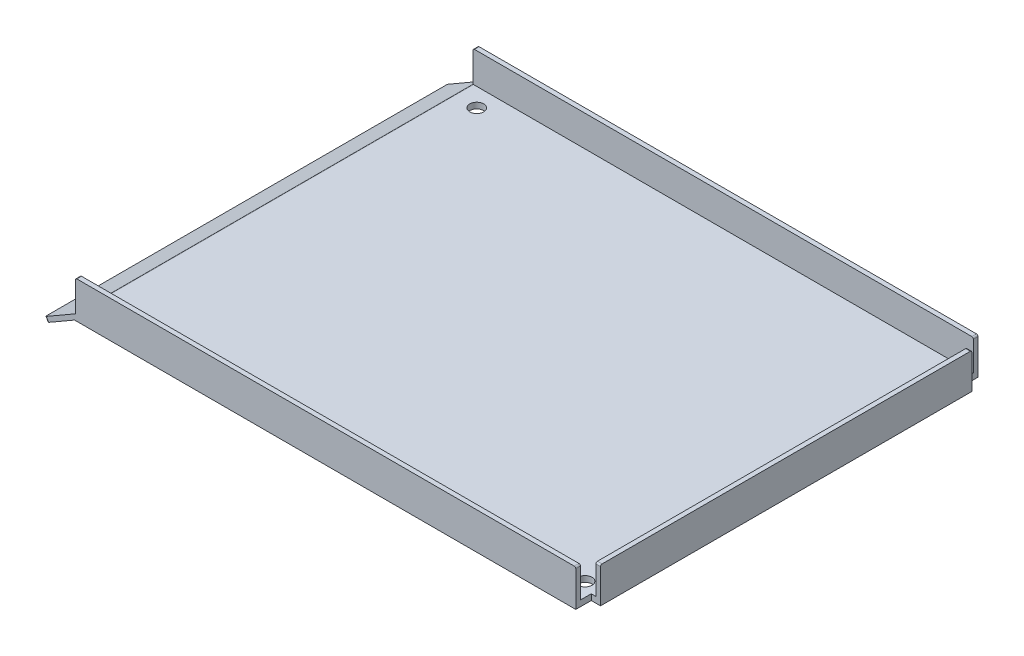
ISO-10303-21;
HEADER;
FILE_DESCRIPTION(('STEP AP214'),'2;1');
FILE_NAME('part.step','',(''),(''),'','','');
FILE_SCHEMA(('AUTOMOTIVE_DESIGN { 1 0 10303 214 1 1 1 1 }'));
ENDSEC;
DATA;
#1=APPLICATION_CONTEXT('core data for automotive mechanical design processes');
#2=APPLICATION_PROTOCOL_DEFINITION('international standard','automotive_design',2000,#1);
#3=PRODUCT_CONTEXT('',#1,'mechanical');
#4=PRODUCT('Part','Part','',(#3));
#5=PRODUCT_RELATED_PRODUCT_CATEGORY('part','',(#4));
#6=PRODUCT_DEFINITION_FORMATION('','',#4);
#7=PRODUCT_DEFINITION_CONTEXT('part definition',#1,'design');
#8=PRODUCT_DEFINITION('design','',#6,#7);
#9=PRODUCT_DEFINITION_SHAPE('','',#8);
#10=(LENGTH_UNIT() NAMED_UNIT(*) SI_UNIT(.MILLI.,.METRE.));
#11=(NAMED_UNIT(*) PLANE_ANGLE_UNIT() SI_UNIT($,.RADIAN.));
#12=(NAMED_UNIT(*) SI_UNIT($,.STERADIAN.) SOLID_ANGLE_UNIT());
#13=UNCERTAINTY_MEASURE_WITH_UNIT(LENGTH_MEASURE(1.E-05),#10,'distance_accuracy_value','');
#14=(GEOMETRIC_REPRESENTATION_CONTEXT(3) GLOBAL_UNCERTAINTY_ASSIGNED_CONTEXT((#13)) GLOBAL_UNIT_ASSIGNED_CONTEXT((#10,
#11,#12)) REPRESENTATION_CONTEXT('',''));
#15=CARTESIAN_POINT('',(0.,0.,0.));
#16=DIRECTION('',(0.,0.,1.));
#17=DIRECTION('',(1.,0.,0.));
#18=AXIS2_PLACEMENT_3D('',#15,#16,#17);
#19=CARTESIAN_POINT('',(-4.8576507151285,2.3268690459354,130.));
#20=DIRECTION('',(0.,-1.,0.));
#21=DIRECTION('',(1.,0.,0.));
#22=AXIS2_PLACEMENT_3D('',#19,#20,#21);
#23=PLANE('',#22);
#24=CARTESIAN_POINT('',(2.36155756905737,2.3268690459354,7.5));
#25=DIRECTION('',(0.,1.,0.));
#26=DIRECTION('',(-1.,0.,0.));
#27=AXIS2_PLACEMENT_3D('',#24,#25,#26);
#28=CIRCLE('',#27,2.25);
#29=CARTESIAN_POINT('',(0.11155756905737,2.3268690459354,7.5));
#30=VERTEX_POINT('',#29);
#31=EDGE_CURVE('E333',#30,#30,#28,.T.);
#32=ORIENTED_EDGE('',*,*,#31,.F.);
#33=EDGE_LOOP('',(#32));
#34=FACE_BOUND('',#33,.T.);
#35=CARTESIAN_POINT('',(152.361557569057,2.32686904593544,7.5));
#36=DIRECTION('',(0.,1.,0.));
#37=DIRECTION('',(-1.,0.,0.));
#38=AXIS2_PLACEMENT_3D('',#35,#36,#37);
#39=CIRCLE('',#38,2.25000000000001);
#40=CARTESIAN_POINT('',(150.111557569057,2.32686904593544,7.5));
#41=VERTEX_POINT('',#40);
#42=EDGE_CURVE('E830',#41,#41,#39,.T.);
#43=ORIENTED_EDGE('',*,*,#42,.F.);
#44=EDGE_LOOP('',(#43));
#45=FACE_BOUND('',#44,.T.);
#46=CARTESIAN_POINT('',(152.361557569057,2.32686904593544,122.5));
#47=DIRECTION('',(0.,1.,0.));
#48=DIRECTION('',(-1.,0.,0.));
#49=AXIS2_PLACEMENT_3D('',#46,#47,#48);
#50=CIRCLE('',#49,2.25000000000001);
#51=CARTESIAN_POINT('',(150.111557569057,2.32686904593544,122.5));
#52=VERTEX_POINT('',#51);
#53=EDGE_CURVE('E810',#52,#52,#50,.T.);
#54=ORIENTED_EDGE('',*,*,#53,.F.);
#55=EDGE_LOOP('',(#54));
#56=FACE_BOUND('',#55,.T.);
#57=CARTESIAN_POINT('',(2.36155756905737,2.3268690459354,122.5));
#58=DIRECTION('',(0.,1.,0.));
#59=DIRECTION('',(-1.,0.,0.));
#60=AXIS2_PLACEMENT_3D('',#57,#58,#59);
#61=CIRCLE('',#60,2.25);
#62=CARTESIAN_POINT('',(0.11155756905737,2.3268690459354,122.5));
#63=VERTEX_POINT('',#62);
#64=EDGE_CURVE('E328',#63,#63,#61,.T.);
#65=ORIENTED_EDGE('',*,*,#64,.F.);
#66=EDGE_LOOP('',(#65));
#67=FACE_BOUND('',#66,.T.);
#68=DIRECTION('',(1.,0.,0.));
#69=VECTOR('',#68,1.);
#70=CARTESIAN_POINT('',(-4.8576507151285,2.3268690459354,1.5));
#71=LINE('',#70,#69);
#72=CARTESIAN_POINT('',(-4.72367611891294,2.3268690459354,1.5));
#73=VERTEX_POINT('',#72);
#74=CARTESIAN_POINT('',(156.861557569057,2.32686904593544,1.5));
#75=VERTEX_POINT('',#74);
#76=EDGE_CURVE('E418',#73,#75,#71,.T.);
#77=ORIENTED_EDGE('',*,*,#76,.F.);
#78=DIRECTION('',(0.,0.,-1.));
#79=VECTOR('',#78,1.);
#80=CARTESIAN_POINT('',(-4.72367611891294,2.3268690459354,130.));
#81=LINE('',#80,#79);
#82=CARTESIAN_POINT('',(-4.72367611891294,2.3268690459354,128.5));
#83=VERTEX_POINT('',#82);
#84=EDGE_CURVE('E236',#73,#83,#81,.F.);
#85=ORIENTED_EDGE('',*,*,#84,.T.);
#86=DIRECTION('',(-1.,0.,0.));
#87=VECTOR('',#86,1.);
#88=CARTESIAN_POINT('',(156.861557569057,2.32686904593544,128.5));
#89=LINE('',#88,#87);
#90=CARTESIAN_POINT('',(156.861557569057,2.32686904593544,128.5));
#91=VERTEX_POINT('',#90);
#92=EDGE_CURVE('E216',#91,#83,#89,.T.);
#93=ORIENTED_EDGE('',*,*,#92,.F.);
#94=DIRECTION('',(0.,0.,-1.));
#95=VECTOR('',#94,1.);
#96=CARTESIAN_POINT('',(156.861557569057,2.32686904593544,130.));
#97=LINE('',#96,#95);
#98=CARTESIAN_POINT('',(156.861557569057,2.32686904593544,125.));
#99=VERTEX_POINT('',#98);
#100=EDGE_CURVE('E225',#91,#99,#97,.T.);
#101=ORIENTED_EDGE('',*,*,#100,.T.);
#102=DIRECTION('',(1.,0.,0.));
#103=VECTOR('',#102,1.);
#104=CARTESIAN_POINT('',(-4.8576507151285,2.3268690459354,125.));
#105=LINE('',#104,#103);
#106=CARTESIAN_POINT('',(158.361557569057,2.32686904593544,125.));
#107=VERTEX_POINT('',#106);
#108=EDGE_CURVE('E232',#99,#107,#105,.T.);
#109=ORIENTED_EDGE('',*,*,#108,.T.);
#110=DIRECTION('',(0.,0.,-1.));
#111=VECTOR('',#110,1.);
#112=CARTESIAN_POINT('',(158.361557569057,2.32686904593544,130.));
#113=LINE('',#112,#111);
#114=CARTESIAN_POINT('',(158.361557569057,2.32686904593544,5.));
#115=VERTEX_POINT('',#114);
#116=EDGE_CURVE('E285',#107,#115,#113,.T.);
#117=ORIENTED_EDGE('',*,*,#116,.T.);
#118=DIRECTION('',(-1.,0.,0.));
#119=VECTOR('',#118,1.);
#120=CARTESIAN_POINT('',(-4.85765071512854,2.3268690459354,5.00000000000005));
#121=LINE('',#120,#119);
#122=CARTESIAN_POINT('',(156.861557569057,2.32686904593544,5.));
#123=VERTEX_POINT('',#122);
#124=EDGE_CURVE('E264',#115,#123,#121,.T.);
#125=ORIENTED_EDGE('',*,*,#124,.T.);
#126=DIRECTION('',(0.,0.,-1.));
#127=VECTOR('',#126,1.);
#128=CARTESIAN_POINT('',(156.861557569057,2.32686904593544,130.));
#129=LINE('',#128,#127);
#130=EDGE_CURVE('E260',#123,#75,#129,.T.);
#131=ORIENTED_EDGE('',*,*,#130,.T.);
#132=EDGE_LOOP('',(#77,#85,#93,#101,#109,#117,#125,#131));
#133=FACE_BOUND('',#132,.T.);
#134=ADVANCED_FACE('F33',(#34,#45,#56,#67,#133),#23,.F.);
#135=CARTESIAN_POINT('',(-4.8576507151285,2.3268690459354,130.));
#136=DIRECTION('',(0.499999999999995,-0.866025403784441,0.));
#137=DIRECTION('',(0.866025403784441,0.499999999999995,0.));
#138=AXIS2_PLACEMENT_3D('',#135,#136,#137);
#139=PLANE('',#138);
#140=DIRECTION('',(0.,0.,-1.));
#141=VECTOR('',#140,1.);
#142=CARTESIAN_POINT('',(-14.6384424309426,-3.32007368407747,130.));
#143=LINE('',#142,#141);
#144=CARTESIAN_POINT('',(-14.6384424309426,-3.32007368407747,129.5));
#145=VERTEX_POINT('',#144);
#146=CARTESIAN_POINT('',(-14.6384424309426,-3.32007368407747,0.5));
#147=VERTEX_POINT('',#146);
#148=EDGE_CURVE('E309',#145,#147,#143,.T.);
#149=ORIENTED_EDGE('',*,*,#148,.F.);
#150=CARTESIAN_POINT('',(-14.2054297290504,-3.07007368407748,129.5));
#151=DIRECTION('',(0.499999999999995,-0.866025403784441,0.));
#152=DIRECTION('',(0.866025403784441,0.499999999999995,0.));
#153=AXIS2_PLACEMENT_3D('',#150,#151,#152);
#154=CIRCLE('',#153,0.5);
#155=CARTESIAN_POINT('',(-14.2054297290504,-3.07007368407748,130.));
#156=VERTEX_POINT('',#155);
#157=EDGE_CURVE('E413',#145,#156,#154,.F.);
#158=ORIENTED_EDGE('',*,*,#157,.T.);
#159=DIRECTION('',(-0.866025403784441,-0.499999999999995,0.));
#160=VECTOR('',#159,1.);
#161=CARTESIAN_POINT('',(-4.8576507151285,2.3268690459354,130.));
#162=LINE('',#161,#160);
#163=CARTESIAN_POINT('',(-4.8576507151285,2.3268690459354,130.));
#164=VERTEX_POINT('',#163);
#165=EDGE_CURVE('E276',#164,#156,#162,.T.);
#166=ORIENTED_EDGE('',*,*,#165,.F.);
#167=DIRECTION('',(0.,0.,-1.));
#168=VECTOR('',#167,1.);
#169=CARTESIAN_POINT('',(-4.8576507151285,2.3268690459354,130.));
#170=LINE('',#169,#168);
#171=CARTESIAN_POINT('',(-4.8576507151285,2.3268690459354,128.5));
#172=VERTEX_POINT('',#171);
#173=EDGE_CURVE('E312',#164,#172,#170,.T.);
#174=ORIENTED_EDGE('',*,*,#173,.T.);
#175=DIRECTION('',(-0.866025403784441,-0.499999999999995,0.));
#176=VECTOR('',#175,1.);
#177=CARTESIAN_POINT('',(-4.8576507151285,2.3268690459354,128.5));
#178=LINE('',#177,#176);
#179=CARTESIAN_POINT('',(-4.97367611891294,2.25988174782762,128.5));
#180=VERTEX_POINT('',#179);
#181=EDGE_CURVE('E47',#172,#180,#178,.T.);
#182=ORIENTED_EDGE('',*,*,#181,.T.);
#183=DIRECTION('',(0.,0.,-1.));
#184=VECTOR('',#183,1.);
#185=CARTESIAN_POINT('',(-4.97367611891294,2.25988174782762,130.));
#186=LINE('',#185,#184);
#187=CARTESIAN_POINT('',(-4.97367611891294,2.25988174782762,1.5));
#188=VERTEX_POINT('',#187);
#189=EDGE_CURVE('E408',#180,#188,#186,.T.);
#190=ORIENTED_EDGE('',*,*,#189,.T.);
#191=DIRECTION('',(0.866025403784441,0.499999999999995,0.));
#192=VECTOR('',#191,1.);
#193=CARTESIAN_POINT('',(-4.8576507151285,2.3268690459354,1.5));
#194=LINE('',#193,#192);
#195=CARTESIAN_POINT('',(-4.8576507151285,2.3268690459354,1.5));
#196=VERTEX_POINT('',#195);
#197=EDGE_CURVE('E411',#188,#196,#194,.T.);
#198=ORIENTED_EDGE('',*,*,#197,.T.);
#199=DIRECTION('',(0.,0.,1.));
#200=VECTOR('',#199,1.);
#201=CARTESIAN_POINT('',(-4.8576507151285,2.3268690459354,0.));
#202=LINE('',#201,#200);
#203=CARTESIAN_POINT('',(-4.8576507151285,2.3268690459354,0.));
#204=VERTEX_POINT('',#203);
#205=EDGE_CURVE('E327',#204,#196,#202,.T.);
#206=ORIENTED_EDGE('',*,*,#205,.F.);
#207=DIRECTION('',(-0.866025403784441,-0.499999999999995,0.));
#208=VECTOR('',#207,1.);
#209=CARTESIAN_POINT('',(-4.8576507151285,2.3268690459354,0.));
#210=LINE('',#209,#208);
#211=CARTESIAN_POINT('',(-14.2054297290504,-3.07007368407748,0.));
#212=VERTEX_POINT('',#211);
#213=EDGE_CURVE('E275',#204,#212,#210,.T.);
#214=ORIENTED_EDGE('',*,*,#213,.T.);
#215=CARTESIAN_POINT('',(-14.2054297290504,-3.07007368407748,0.5));
#216=DIRECTION('',(0.499999999999995,-0.866025403784441,0.));
#217=DIRECTION('',(0.866025403784441,0.499999999999995,0.));
#218=AXIS2_PLACEMENT_3D('',#215,#216,#217);
#219=CIRCLE('',#218,0.5);
#220=EDGE_CURVE('E405',#212,#147,#219,.F.);
#221=ORIENTED_EDGE('',*,*,#220,.T.);
#222=EDGE_LOOP('',(#149,#158,#166,#174,#182,#190,#198,#206,#214,#221));
#223=FACE_BOUND('',#222,.T.);
#224=ADVANCED_FACE('F425',(#223),#139,.F.);
#225=CARTESIAN_POINT('',(-14.6384424309426,-3.32007368407747,130.));
#226=DIRECTION('',(0.866025403784441,0.499999999999996,0.));
#227=DIRECTION('',(-0.499999999999996,0.866025403784441,0.));
#228=AXIS2_PLACEMENT_3D('',#225,#226,#227);
#229=PLANE('',#228);
#230=DIRECTION('',(0.,0.,-1.));
#231=VECTOR('',#230,1.);
#232=CARTESIAN_POINT('',(-13.8884424309426,-4.61911178975414,130.));
#233=LINE('',#232,#231);
#234=CARTESIAN_POINT('',(-13.8884424309426,-4.61911178975414,129.5));
#235=VERTEX_POINT('',#234);
#236=CARTESIAN_POINT('',(-13.8884424309426,-4.61911178975414,0.5));
#237=VERTEX_POINT('',#236);
#238=EDGE_CURVE('E306',#235,#237,#233,.T.);
#239=ORIENTED_EDGE('',*,*,#238,.F.);
#240=DIRECTION('',(0.499999999999996,-0.866025403784441,0.));
#241=VECTOR('',#240,1.);
#242=CARTESIAN_POINT('',(-14.6384424309426,-3.32007368407747,129.5));
#243=LINE('',#242,#241);
#244=EDGE_CURVE('E403',#235,#145,#243,.F.);
#245=ORIENTED_EDGE('',*,*,#244,.T.);
#246=ORIENTED_EDGE('',*,*,#148,.T.);
#247=DIRECTION('',(0.499999999999996,-0.866025403784441,0.));
#248=VECTOR('',#247,1.);
#249=CARTESIAN_POINT('',(-14.6384424309426,-3.32007368407747,0.5));
#250=LINE('',#249,#248);
#251=EDGE_CURVE('E400',#147,#237,#250,.T.);
#252=ORIENTED_EDGE('',*,*,#251,.T.);
#253=EDGE_LOOP('',(#239,#245,#246,#252));
#254=FACE_BOUND('',#253,.T.);
#255=ADVANCED_FACE('F504',(#254),#229,.F.);
#256=CARTESIAN_POINT('',(-13.8884424309426,-4.61911178975414,130.));
#257=DIRECTION('',(-0.499999999999995,0.866025403784441,0.));
#258=DIRECTION('',(-0.866025403784441,-0.499999999999995,0.));
#259=AXIS2_PLACEMENT_3D('',#256,#257,#258);
#260=PLANE('',#259);
#261=DIRECTION('',(0.866025403784441,0.499999999999995,0.));
#262=VECTOR('',#261,1.);
#263=CARTESIAN_POINT('',(-13.8884424309426,-4.61911178975414,130.));
#264=LINE('',#263,#262);
#265=CARTESIAN_POINT('',(-13.4554297290504,-4.36911178975414,130.));
#266=VERTEX_POINT('',#265);
#267=CARTESIAN_POINT('',(-5.13844243094263,0.432703065655029,130.));
#268=VERTEX_POINT('',#267);
#269=EDGE_CURVE('E279',#266,#268,#264,.T.);
#270=ORIENTED_EDGE('',*,*,#269,.F.);
#271=CARTESIAN_POINT('',(-13.4554297290504,-4.36911178975414,129.5));
#272=DIRECTION('',(-0.499999999999995,0.866025403784441,0.));
#273=DIRECTION('',(-0.866025403784441,-0.499999999999995,0.));
#274=AXIS2_PLACEMENT_3D('',#271,#272,#273);
#275=CIRCLE('',#274,0.5);
#276=EDGE_CURVE('E398',#266,#235,#275,.F.);
#277=ORIENTED_EDGE('',*,*,#276,.T.);
#278=ORIENTED_EDGE('',*,*,#238,.T.);
#279=CARTESIAN_POINT('',(-13.4554297290504,-4.36911178975414,0.5));
#280=DIRECTION('',(-0.499999999999995,0.866025403784441,0.));
#281=DIRECTION('',(-0.866025403784441,-0.499999999999995,0.));
#282=AXIS2_PLACEMENT_3D('',#279,#280,#281);
#283=CIRCLE('',#282,0.5);
#284=CARTESIAN_POINT('',(-13.4554297290504,-4.36911178975414,0.));
#285=VERTEX_POINT('',#284);
#286=EDGE_CURVE('E396',#237,#285,#283,.F.);
#287=ORIENTED_EDGE('',*,*,#286,.T.);
#288=DIRECTION('',(0.866025403784441,0.499999999999995,0.));
#289=VECTOR('',#288,1.);
#290=CARTESIAN_POINT('',(-13.8884424309426,-4.61911178975414,0.));
#291=LINE('',#290,#289);
#292=CARTESIAN_POINT('',(-5.13844243094263,0.432703065655029,0.));
#293=VERTEX_POINT('',#292);
#294=EDGE_CURVE('E288',#285,#293,#291,.T.);
#295=ORIENTED_EDGE('',*,*,#294,.T.);
#296=DIRECTION('',(0.,0.,-1.));
#297=VECTOR('',#296,1.);
#298=CARTESIAN_POINT('',(-5.13844243094263,0.432703065655029,130.));
#299=LINE('',#298,#297);
#300=EDGE_CURVE('E303',#268,#293,#299,.T.);
#301=ORIENTED_EDGE('',*,*,#300,.F.);
#302=EDGE_LOOP('',(#270,#277,#278,#287,#295,#301));
#303=FACE_BOUND('',#302,.T.);
#304=ADVANCED_FACE('F457',(#303),#260,.F.);
#305=CARTESIAN_POINT('',(-5.13844243094263,0.432703065655029,130.));
#306=DIRECTION('',(0.,1.,0.));
#307=DIRECTION('',(-1.,0.,0.));
#308=AXIS2_PLACEMENT_3D('',#305,#306,#307);
#309=PLANE('',#308);
#310=CARTESIAN_POINT('',(2.36155756905737,0.43270306565503,7.5));
#311=DIRECTION('',(0.,1.,0.));
#312=DIRECTION('',(-1.,0.,0.));
#313=AXIS2_PLACEMENT_3D('',#310,#311,#312);
#314=CIRCLE('',#313,2.25);
#315=CARTESIAN_POINT('',(0.111557569057371,0.43270306565503,7.5));
#316=VERTEX_POINT('',#315);
#317=EDGE_CURVE('E336',#316,#316,#314,.T.);
#318=ORIENTED_EDGE('',*,*,#317,.T.);
#319=EDGE_LOOP('',(#318));
#320=FACE_BOUND('',#319,.T.);
#321=CARTESIAN_POINT('',(152.361557569057,0.432703065655066,7.5));
#322=DIRECTION('',(0.,1.,0.));
#323=DIRECTION('',(-1.,0.,0.));
#324=AXIS2_PLACEMENT_3D('',#321,#322,#323);
#325=CIRCLE('',#324,2.25000000000001);
#326=CARTESIAN_POINT('',(150.111557569057,0.432703065655065,7.5));
#327=VERTEX_POINT('',#326);
#328=EDGE_CURVE('E332',#327,#327,#325,.T.);
#329=ORIENTED_EDGE('',*,*,#328,.T.);
#330=EDGE_LOOP('',(#329));
#331=FACE_BOUND('',#330,.T.);
#332=CARTESIAN_POINT('',(152.361557569057,0.432703065655066,122.5));
#333=DIRECTION('',(0.,1.,0.));
#334=DIRECTION('',(-1.,0.,0.));
#335=AXIS2_PLACEMENT_3D('',#332,#333,#334);
#336=CIRCLE('',#335,2.25000000000001);
#337=CARTESIAN_POINT('',(150.111557569057,0.432703065655065,122.5));
#338=VERTEX_POINT('',#337);
#339=EDGE_CURVE('E329',#338,#338,#336,.T.);
#340=ORIENTED_EDGE('',*,*,#339,.T.);
#341=EDGE_LOOP('',(#340));
#342=FACE_BOUND('',#341,.T.);
#343=CARTESIAN_POINT('',(2.36155756905737,0.43270306565503,122.5));
#344=DIRECTION('',(0.,1.,0.));
#345=DIRECTION('',(-1.,0.,0.));
#346=AXIS2_PLACEMENT_3D('',#343,#344,#345);
#347=CIRCLE('',#346,2.25);
#348=CARTESIAN_POINT('',(0.11155756905737,0.43270306565503,122.5));
#349=VERTEX_POINT('',#348);
#350=EDGE_CURVE('E324',#349,#349,#347,.T.);
#351=ORIENTED_EDGE('',*,*,#350,.T.);
#352=EDGE_LOOP('',(#351));
#353=FACE_BOUND('',#352,.T.);
#354=DIRECTION('',(1.,0.,0.));
#355=VECTOR('',#354,1.);
#356=CARTESIAN_POINT('',(-5.13844243094263,0.432703065655029,0.));
#357=LINE('',#356,#355);
#358=CARTESIAN_POINT('',(156.861557569057,0.432703065655068,0.));
#359=VERTEX_POINT('',#358);
#360=EDGE_CURVE('E280',#293,#359,#357,.T.);
#361=ORIENTED_EDGE('',*,*,#360,.T.);
#362=DIRECTION('',(0.,0.,-1.));
#363=VECTOR('',#362,1.);
#364=CARTESIAN_POINT('',(156.861557569057,0.432703065655068,0.));
#365=LINE('',#364,#363);
#366=CARTESIAN_POINT('',(156.861557569057,0.432703065655068,5.));
#367=VERTEX_POINT('',#366);
#368=EDGE_CURVE('E254',#367,#359,#365,.T.);
#369=ORIENTED_EDGE('',*,*,#368,.F.);
#370=DIRECTION('',(-1.,0.,0.));
#371=VECTOR('',#370,1.);
#372=CARTESIAN_POINT('',(159.861557569057,0.432703065655068,5.));
#373=LINE('',#372,#371);
#374=CARTESIAN_POINT('',(159.861557569057,0.432703065655068,5.));
#375=VERTEX_POINT('',#374);
#376=EDGE_CURVE('E221',#375,#367,#373,.T.);
#377=ORIENTED_EDGE('',*,*,#376,.F.);
#378=DIRECTION('',(0.,0.,-1.));
#379=VECTOR('',#378,1.);
#380=CARTESIAN_POINT('',(159.861557569057,0.432703065655068,130.));
#381=LINE('',#380,#379);
#382=CARTESIAN_POINT('',(159.861557569057,0.432703065655068,125.));
#383=VERTEX_POINT('',#382);
#384=EDGE_CURVE('E300',#383,#375,#381,.T.);
#385=ORIENTED_EDGE('',*,*,#384,.F.);
#386=DIRECTION('',(1.,0.,0.));
#387=VECTOR('',#386,1.);
#388=CARTESIAN_POINT('',(159.861557569057,0.432703065655068,125.));
#389=LINE('',#388,#387);
#390=CARTESIAN_POINT('',(156.861557569057,0.432703065655068,125.));
#391=VERTEX_POINT('',#390);
#392=EDGE_CURVE('E269',#391,#383,#389,.T.);
#393=ORIENTED_EDGE('',*,*,#392,.F.);
#394=DIRECTION('',(0.,0.,-1.));
#395=VECTOR('',#394,1.);
#396=CARTESIAN_POINT('',(156.861557569057,0.432703065655068,130.));
#397=LINE('',#396,#395);
#398=CARTESIAN_POINT('',(156.861557569057,0.432703065655068,130.));
#399=VERTEX_POINT('',#398);
#400=EDGE_CURVE('E267',#399,#391,#397,.T.);
#401=ORIENTED_EDGE('',*,*,#400,.F.);
#402=DIRECTION('',(1.,0.,0.));
#403=VECTOR('',#402,1.);
#404=CARTESIAN_POINT('',(-5.13844243094263,0.432703065655029,130.));
#405=LINE('',#404,#403);
#406=EDGE_CURVE('E282',#268,#399,#405,.T.);
#407=ORIENTED_EDGE('',*,*,#406,.F.);
#408=ORIENTED_EDGE('',*,*,#300,.T.);
#409=EDGE_LOOP('',(#361,#369,#377,#385,#393,#401,#407,#408));
#410=FACE_BOUND('',#409,.T.);
#411=ADVANCED_FACE('F451',(#320,#331,#342,#353,#410),#309,.F.);
#412=CARTESIAN_POINT('',(159.861557569057,0.432703065655068,130.));
#413=DIRECTION('',(-1.,0.,0.));
#414=DIRECTION('',(0.,0.,1.));
#415=AXIS2_PLACEMENT_3D('',#412,#413,#414);
#416=PLANE('',#415);
#417=DIRECTION('',(0.,-1.,0.));
#418=VECTOR('',#417,1.);
#419=CARTESIAN_POINT('',(159.861557569057,11.9327030656551,5.));
#420=LINE('',#419,#418);
#421=CARTESIAN_POINT('',(159.861557569057,11.4327030656551,5.));
#422=VERTEX_POINT('',#421);
#423=EDGE_CURVE('E257',#422,#375,#420,.T.);
#424=ORIENTED_EDGE('',*,*,#423,.F.);
#425=CARTESIAN_POINT('',(159.861557569057,11.4327030656551,5.50000000000001));
#426=DIRECTION('',(-1.,0.,0.));
#427=DIRECTION('',(0.,0.,1.));
#428=AXIS2_PLACEMENT_3D('',#425,#426,#427);
#429=CIRCLE('',#428,0.5);
#430=CARTESIAN_POINT('',(159.861557569057,11.9327030656551,5.50000000000001));
#431=VERTEX_POINT('',#430);
#432=EDGE_CURVE('E370',#422,#431,#429,.F.);
#433=ORIENTED_EDGE('',*,*,#432,.T.);
#434=DIRECTION('',(0.,0.,-1.));
#435=VECTOR('',#434,1.);
#436=CARTESIAN_POINT('',(159.861557569057,11.9327030656551,130.));
#437=LINE('',#436,#435);
#438=CARTESIAN_POINT('',(159.861557569057,11.9327030656551,124.5));
#439=VERTEX_POINT('',#438);
#440=EDGE_CURVE('E297',#439,#431,#437,.T.);
#441=ORIENTED_EDGE('',*,*,#440,.F.);
#442=CARTESIAN_POINT('',(159.861557569057,11.4327030656551,124.5));
#443=DIRECTION('',(-1.,0.,0.));
#444=DIRECTION('',(0.,0.,1.));
#445=AXIS2_PLACEMENT_3D('',#442,#443,#444);
#446=CIRCLE('',#445,0.5);
#447=CARTESIAN_POINT('',(159.861557569057,11.4327030656551,125.));
#448=VERTEX_POINT('',#447);
#449=EDGE_CURVE('E368',#439,#448,#446,.F.);
#450=ORIENTED_EDGE('',*,*,#449,.T.);
#451=DIRECTION('',(0.,-1.,0.));
#452=VECTOR('',#451,1.);
#453=CARTESIAN_POINT('',(159.861557569057,11.9327030656551,125.));
#454=LINE('',#453,#452);
#455=EDGE_CURVE('E233',#448,#383,#454,.T.);
#456=ORIENTED_EDGE('',*,*,#455,.T.);
#457=ORIENTED_EDGE('',*,*,#384,.T.);
#458=EDGE_LOOP('',(#424,#433,#441,#450,#456,#457));
#459=FACE_BOUND('',#458,.T.);
#460=ADVANCED_FACE('F474',(#459),#416,.F.);
#461=CARTESIAN_POINT('',(159.861557569057,11.9327030656551,130.));
#462=DIRECTION('',(0.,-1.,0.));
#463=DIRECTION('',(1.,0.,0.));
#464=AXIS2_PLACEMENT_3D('',#461,#462,#463);
#465=PLANE('',#464);
#466=ORIENTED_EDGE('',*,*,#440,.T.);
#467=DIRECTION('',(-1.,0.,0.));
#468=VECTOR('',#467,1.);
#469=CARTESIAN_POINT('',(159.861557569057,11.9327030656551,5.50000000000001));
#470=LINE('',#469,#468);
#471=CARTESIAN_POINT('',(158.361557569057,11.9327030656551,5.50000000000001));
#472=VERTEX_POINT('',#471);
#473=EDGE_CURVE('E359',#431,#472,#470,.T.);
#474=ORIENTED_EDGE('',*,*,#473,.T.);
#475=DIRECTION('',(0.,0.,-1.));
#476=VECTOR('',#475,1.);
#477=CARTESIAN_POINT('',(158.361557569057,11.9327030656551,130.));
#478=LINE('',#477,#476);
#479=CARTESIAN_POINT('',(158.361557569057,11.9327030656551,124.5));
#480=VERTEX_POINT('',#479);
#481=EDGE_CURVE('E294',#480,#472,#478,.T.);
#482=ORIENTED_EDGE('',*,*,#481,.F.);
#483=DIRECTION('',(1.,0.,0.));
#484=VECTOR('',#483,1.);
#485=CARTESIAN_POINT('',(159.861557569057,11.9327030656551,124.5));
#486=LINE('',#485,#484);
#487=EDGE_CURVE('E356',#480,#439,#486,.T.);
#488=ORIENTED_EDGE('',*,*,#487,.T.);
#489=EDGE_LOOP('',(#466,#474,#482,#488));
#490=FACE_BOUND('',#489,.T.);
#491=ADVANCED_FACE('F560',(#490),#465,.F.);
#492=CARTESIAN_POINT('',(158.361557569057,2.32686904593544,130.));
#493=DIRECTION('',(1.,0.,0.));
#494=DIRECTION('',(0.,0.,-1.));
#495=AXIS2_PLACEMENT_3D('',#492,#493,#494);
#496=PLANE('',#495);
#497=ORIENTED_EDGE('',*,*,#481,.T.);
#498=CARTESIAN_POINT('',(158.361557569057,11.4327030656551,5.50000000000001));
#499=DIRECTION('',(1.,0.,0.));
#500=DIRECTION('',(0.,0.,-1.));
#501=AXIS2_PLACEMENT_3D('',#498,#499,#500);
#502=CIRCLE('',#501,0.5);
#503=CARTESIAN_POINT('',(158.361557569057,11.4327030656551,5.));
#504=VERTEX_POINT('',#503);
#505=EDGE_CURVE('E364',#472,#504,#502,.F.);
#506=ORIENTED_EDGE('',*,*,#505,.T.);
#507=DIRECTION('',(0.,-1.,0.));
#508=VECTOR('',#507,1.);
#509=CARTESIAN_POINT('',(158.361557569057,2.32686904593544,5.));
#510=LINE('',#509,#508);
#511=EDGE_CURVE('E321',#504,#115,#510,.T.);
#512=ORIENTED_EDGE('',*,*,#511,.T.);
#513=ORIENTED_EDGE('',*,*,#116,.F.);
#514=DIRECTION('',(0.,1.,0.));
#515=VECTOR('',#514,1.);
#516=CARTESIAN_POINT('',(158.361557569057,2.32686904593544,125.));
#517=LINE('',#516,#515);
#518=CARTESIAN_POINT('',(158.361557569057,11.4327030656551,125.));
#519=VERTEX_POINT('',#518);
#520=EDGE_CURVE('E316',#107,#519,#517,.T.);
#521=ORIENTED_EDGE('',*,*,#520,.T.);
#522=CARTESIAN_POINT('',(158.361557569057,11.4327030656551,124.5));
#523=DIRECTION('',(1.,0.,0.));
#524=DIRECTION('',(0.,0.,-1.));
#525=AXIS2_PLACEMENT_3D('',#522,#523,#524);
#526=CIRCLE('',#525,0.5);
#527=EDGE_CURVE('E362',#519,#480,#526,.F.);
#528=ORIENTED_EDGE('',*,*,#527,.T.);
#529=EDGE_LOOP('',(#497,#506,#512,#513,#521,#528));
#530=FACE_BOUND('',#529,.T.);
#531=ADVANCED_FACE('F483',(#530),#496,.F.);
#532=CARTESIAN_POINT('',(0.,0.,130.));
#533=DIRECTION('',(0.,0.,1.));
#534=DIRECTION('',(1.,0.,0.));
#535=AXIS2_PLACEMENT_3D('',#532,#533,#534);
#536=PLANE('',#535);
#537=DIRECTION('',(0.,-1.,0.));
#538=VECTOR('',#537,1.);
#539=CARTESIAN_POINT('',(156.861557569057,0.,130.));
#540=LINE('',#539,#538);
#541=CARTESIAN_POINT('',(156.861557569057,11.8268690459354,130.));
#542=VERTEX_POINT('',#541);
#543=EDGE_CURVE('E314',#542,#399,#540,.T.);
#544=ORIENTED_EDGE('',*,*,#543,.F.);
#545=CARTESIAN_POINT('',(156.361557569057,11.8268690459354,130.));
#546=DIRECTION('',(0.,0.,1.));
#547=DIRECTION('',(1.,0.,0.));
#548=AXIS2_PLACEMENT_3D('',#545,#546,#547);
#549=CIRCLE('',#548,0.5);
#550=CARTESIAN_POINT('',(156.361557569057,12.3268690459354,130.));
#551=VERTEX_POINT('',#550);
#552=EDGE_CURVE('E388',#542,#551,#549,.T.);
#553=ORIENTED_EDGE('',*,*,#552,.T.);
#554=DIRECTION('',(1.,0.,0.));
#555=VECTOR('',#554,1.);
#556=CARTESIAN_POINT('',(156.861557569057,12.3268690459354,130.));
#557=LINE('',#556,#555);
#558=CARTESIAN_POINT('',(-4.3576507151285,12.3268690459354,130.));
#559=VERTEX_POINT('',#558);
#560=EDGE_CURVE('E241',#559,#551,#557,.T.);
#561=ORIENTED_EDGE('',*,*,#560,.F.);
#562=CARTESIAN_POINT('',(-4.35765071512851,11.8268690459354,130.));
#563=DIRECTION('',(0.,0.,1.));
#564=DIRECTION('',(1.,0.,0.));
#565=AXIS2_PLACEMENT_3D('',#562,#563,#564);
#566=CIRCLE('',#565,0.5);
#567=CARTESIAN_POINT('',(-4.85765071512851,11.8268690459354,130.));
#568=VERTEX_POINT('',#567);
#569=EDGE_CURVE('E386',#559,#568,#566,.T.);
#570=ORIENTED_EDGE('',*,*,#569,.T.);
#571=DIRECTION('',(0.,-1.,0.));
#572=VECTOR('',#571,1.);
#573=CARTESIAN_POINT('',(-4.85765071512851,12.3268690459354,130.));
#574=LINE('',#573,#572);
#575=EDGE_CURVE('E248',#568,#164,#574,.T.);
#576=ORIENTED_EDGE('',*,*,#575,.T.);
#577=ORIENTED_EDGE('',*,*,#165,.T.);
#578=DIRECTION('',(0.499999999999996,-0.866025403784441,0.));
#579=VECTOR('',#578,1.);
#580=CARTESIAN_POINT('',(-13.4554297290504,-4.36911178975414,130.));
#581=LINE('',#580,#579);
#582=EDGE_CURVE('E383',#156,#266,#581,.T.);
#583=ORIENTED_EDGE('',*,*,#582,.T.);
#584=ORIENTED_EDGE('',*,*,#269,.T.);
#585=ORIENTED_EDGE('',*,*,#406,.T.);
#586=EDGE_LOOP('',(#544,#553,#561,#570,#576,#577,#583,#584,#585));
#587=FACE_BOUND('',#586,.T.);
#588=ADVANCED_FACE('F443',(#587),#536,.T.);
#589=CARTESIAN_POINT('',(0.,0.,0.));
#590=DIRECTION('',(0.,0.,1.));
#591=DIRECTION('',(1.,0.,0.));
#592=AXIS2_PLACEMENT_3D('',#589,#590,#591);
#593=PLANE('',#592);
#594=DIRECTION('',(-1.,0.,0.));
#595=VECTOR('',#594,1.);
#596=CARTESIAN_POINT('',(-4.85765071512851,12.3268690459354,0.));
#597=LINE('',#596,#595);
#598=CARTESIAN_POINT('',(156.361557569057,12.3268690459354,0.));
#599=VERTEX_POINT('',#598);
#600=CARTESIAN_POINT('',(-4.35765071512851,12.3268690459354,0.));
#601=VERTEX_POINT('',#600);
#602=EDGE_CURVE('E814',#599,#601,#597,.T.);
#603=ORIENTED_EDGE('',*,*,#602,.F.);
#604=CARTESIAN_POINT('',(156.361557569057,11.8268690459354,0.));
#605=DIRECTION('',(0.,0.,1.));
#606=DIRECTION('',(1.,0.,0.));
#607=AXIS2_PLACEMENT_3D('',#604,#605,#606);
#608=CIRCLE('',#607,0.5);
#609=CARTESIAN_POINT('',(156.861557569057,11.8268690459354,0.));
#610=VERTEX_POINT('',#609);
#611=EDGE_CURVE('E348',#599,#610,#608,.F.);
#612=ORIENTED_EDGE('',*,*,#611,.T.);
#613=DIRECTION('',(0.,-1.,0.));
#614=VECTOR('',#613,1.);
#615=CARTESIAN_POINT('',(156.861557569057,0.,0.));
#616=LINE('',#615,#614);
#617=EDGE_CURVE('E319',#610,#359,#616,.T.);
#618=ORIENTED_EDGE('',*,*,#617,.T.);
#619=ORIENTED_EDGE('',*,*,#360,.F.);
#620=ORIENTED_EDGE('',*,*,#294,.F.);
#621=DIRECTION('',(0.499999999999996,-0.866025403784441,0.));
#622=VECTOR('',#621,1.);
#623=CARTESIAN_POINT('',(-11.9834531977384,-6.91864992953549,0.));
#624=LINE('',#623,#622);
#625=EDGE_CURVE('E344',#285,#212,#624,.F.);
#626=ORIENTED_EDGE('',*,*,#625,.T.);
#627=ORIENTED_EDGE('',*,*,#213,.F.);
#628=DIRECTION('',(0.,-1.,0.));
#629=VECTOR('',#628,1.);
#630=CARTESIAN_POINT('',(-4.85765071512851,12.3268690459354,0.));
#631=LINE('',#630,#629);
#632=CARTESIAN_POINT('',(-4.85765071512851,11.8268690459354,0.));
#633=VERTEX_POINT('',#632);
#634=EDGE_CURVE('E817',#633,#204,#631,.T.);
#635=ORIENTED_EDGE('',*,*,#634,.F.);
#636=CARTESIAN_POINT('',(-4.35765071512851,11.8268690459354,0.));
#637=DIRECTION('',(0.,0.,1.));
#638=DIRECTION('',(1.,0.,0.));
#639=AXIS2_PLACEMENT_3D('',#636,#637,#638);
#640=CIRCLE('',#639,0.5);
#641=EDGE_CURVE('E346',#633,#601,#640,.F.);
#642=ORIENTED_EDGE('',*,*,#641,.T.);
#643=EDGE_LOOP('',(#603,#612,#618,#619,#620,#626,#627,#635,#642));
#644=FACE_BOUND('',#643,.T.);
#645=ADVANCED_FACE('F463',(#644),#593,.F.);
#646=CARTESIAN_POINT('',(159.861557569057,11.9327030656551,125.));
#647=DIRECTION('',(0.,0.,-1.));
#648=DIRECTION('',(-1.,0.,0.));
#649=AXIS2_PLACEMENT_3D('',#646,#647,#648);
#650=PLANE('',#649);
#651=ORIENTED_EDGE('',*,*,#455,.F.);
#652=DIRECTION('',(1.,0.,0.));
#653=VECTOR('',#652,1.);
#654=CARTESIAN_POINT('',(159.861557569057,11.4327030656551,125.));
#655=LINE('',#654,#653);
#656=EDGE_CURVE('E390',#448,#519,#655,.F.);
#657=ORIENTED_EDGE('',*,*,#656,.T.);
#658=ORIENTED_EDGE('',*,*,#520,.F.);
#659=ORIENTED_EDGE('',*,*,#108,.F.);
#660=DIRECTION('',(0.,-1.,0.));
#661=VECTOR('',#660,1.);
#662=CARTESIAN_POINT('',(156.861557569057,11.9327030656551,125.));
#663=LINE('',#662,#661);
#664=EDGE_CURVE('E228',#99,#391,#663,.T.);
#665=ORIENTED_EDGE('',*,*,#664,.T.);
#666=ORIENTED_EDGE('',*,*,#392,.T.);
#667=EDGE_LOOP('',(#651,#657,#658,#659,#665,#666));
#668=FACE_BOUND('',#667,.T.);
#669=ADVANCED_FACE('F480',(#668),#650,.F.);
#670=CARTESIAN_POINT('',(156.861557569057,11.9327030656551,130.));
#671=DIRECTION('',(-1.,0.,0.));
#672=DIRECTION('',(0.,-1.,0.));
#673=AXIS2_PLACEMENT_3D('',#670,#671,#672);
#674=PLANE('',#673);
#675=DIRECTION('',(0.,-1.,0.));
#676=VECTOR('',#675,1.);
#677=CARTESIAN_POINT('',(156.861557569057,12.3268690459354,128.5));
#678=LINE('',#677,#676);
#679=CARTESIAN_POINT('',(156.861557569057,11.8268690459354,128.5));
#680=VERTEX_POINT('',#679);
#681=EDGE_CURVE('E211',#680,#91,#678,.T.);
#682=ORIENTED_EDGE('',*,*,#681,.F.);
#683=DIRECTION('',(0.,0.,-1.));
#684=VECTOR('',#683,1.);
#685=CARTESIAN_POINT('',(156.861557569057,11.8268690459354,130.));
#686=LINE('',#685,#684);
#687=EDGE_CURVE('E381',#680,#542,#686,.F.);
#688=ORIENTED_EDGE('',*,*,#687,.T.);
#689=ORIENTED_EDGE('',*,*,#543,.T.);
#690=ORIENTED_EDGE('',*,*,#400,.T.);
#691=ORIENTED_EDGE('',*,*,#664,.F.);
#692=ORIENTED_EDGE('',*,*,#100,.F.);
#693=EDGE_LOOP('',(#682,#688,#689,#690,#691,#692));
#694=FACE_BOUND('',#693,.T.);
#695=ADVANCED_FACE('F226',(#694),#674,.F.);
#696=CARTESIAN_POINT('',(159.861557569057,11.9327030656551,5.));
#697=DIRECTION('',(0.,0.,1.));
#698=DIRECTION('',(1.,0.,0.));
#699=AXIS2_PLACEMENT_3D('',#696,#697,#698);
#700=PLANE('',#699);
#701=ORIENTED_EDGE('',*,*,#511,.F.);
#702=DIRECTION('',(-1.,0.,0.));
#703=VECTOR('',#702,1.);
#704=CARTESIAN_POINT('',(159.861557569057,11.4327030656551,5.));
#705=LINE('',#704,#703);
#706=EDGE_CURVE('E366',#504,#422,#705,.F.);
#707=ORIENTED_EDGE('',*,*,#706,.T.);
#708=ORIENTED_EDGE('',*,*,#423,.T.);
#709=ORIENTED_EDGE('',*,*,#376,.T.);
#710=DIRECTION('',(0.,-1.,0.));
#711=VECTOR('',#710,1.);
#712=CARTESIAN_POINT('',(156.861557569057,11.9327030656551,5.));
#713=LINE('',#712,#711);
#714=EDGE_CURVE('E258',#123,#367,#713,.T.);
#715=ORIENTED_EDGE('',*,*,#714,.F.);
#716=ORIENTED_EDGE('',*,*,#124,.F.);
#717=EDGE_LOOP('',(#701,#707,#708,#709,#715,#716));
#718=FACE_BOUND('',#717,.T.);
#719=ADVANCED_FACE('F488',(#718),#700,.F.);
#720=CARTESIAN_POINT('',(156.861557569057,11.9327030656551,0.));
#721=DIRECTION('',(-1.,0.,0.));
#722=DIRECTION('',(0.,-1.,0.));
#723=AXIS2_PLACEMENT_3D('',#720,#721,#722);
#724=PLANE('',#723);
#725=ORIENTED_EDGE('',*,*,#617,.F.);
#726=DIRECTION('',(0.,0.,-1.));
#727=VECTOR('',#726,1.);
#728=CARTESIAN_POINT('',(156.861557569057,11.8268690459354,1.5));
#729=LINE('',#728,#727);
#730=CARTESIAN_POINT('',(156.861557569057,11.8268690459354,1.5));
#731=VERTEX_POINT('',#730);
#732=EDGE_CURVE('E350',#610,#731,#729,.F.);
#733=ORIENTED_EDGE('',*,*,#732,.T.);
#734=DIRECTION('',(0.,-1.,0.));
#735=VECTOR('',#734,1.);
#736=CARTESIAN_POINT('',(156.861557569057,12.3268690459354,1.5));
#737=LINE('',#736,#735);
#738=EDGE_CURVE('E244',#731,#75,#737,.T.);
#739=ORIENTED_EDGE('',*,*,#738,.T.);
#740=ORIENTED_EDGE('',*,*,#130,.F.);
#741=ORIENTED_EDGE('',*,*,#714,.T.);
#742=ORIENTED_EDGE('',*,*,#368,.T.);
#743=EDGE_LOOP('',(#725,#733,#739,#740,#741,#742));
#744=FACE_BOUND('',#743,.T.);
#745=ADVANCED_FACE('F468',(#744),#724,.F.);
#746=CARTESIAN_POINT('',(156.861557569057,12.3268690459354,128.5));
#747=DIRECTION('',(0.,0.,1.));
#748=DIRECTION('',(1.,0.,0.));
#749=AXIS2_PLACEMENT_3D('',#746,#747,#748);
#750=PLANE('',#749);
#751=DIRECTION('',(-1.,0.,0.));
#752=VECTOR('',#751,1.);
#753=CARTESIAN_POINT('',(156.861557569057,12.3268690459354,128.5));
#754=LINE('',#753,#752);
#755=CARTESIAN_POINT('',(156.361557569057,12.3268690459354,128.5));
#756=VERTEX_POINT('',#755);
#757=CARTESIAN_POINT('',(-4.3576507151285,12.3268690459354,128.5));
#758=VERTEX_POINT('',#757);
#759=EDGE_CURVE('E237',#756,#758,#754,.T.);
#760=ORIENTED_EDGE('',*,*,#759,.F.);
#761=CARTESIAN_POINT('',(156.361557569057,11.8268690459354,128.5));
#762=DIRECTION('',(0.,0.,1.));
#763=DIRECTION('',(1.,0.,0.));
#764=AXIS2_PLACEMENT_3D('',#761,#762,#763);
#765=CIRCLE('',#764,0.5);
#766=EDGE_CURVE('E218',#756,#680,#765,.F.);
#767=ORIENTED_EDGE('',*,*,#766,.T.);
#768=ORIENTED_EDGE('',*,*,#681,.T.);
#769=ORIENTED_EDGE('',*,*,#92,.T.);
#770=CARTESIAN_POINT('',(-4.72367611891294,1.8268690459354,128.5));
#771=DIRECTION('',(0.,0.,1.));
#772=DIRECTION('',(1.,0.,0.));
#773=AXIS2_PLACEMENT_3D('',#770,#771,#772);
#774=CIRCLE('',#773,0.5);
#775=EDGE_CURVE('E11',#83,#180,#774,.T.);
#776=ORIENTED_EDGE('',*,*,#775,.T.);
#777=ORIENTED_EDGE('',*,*,#181,.F.);
#778=DIRECTION('',(0.,-1.,0.));
#779=VECTOR('',#778,1.);
#780=CARTESIAN_POINT('',(-4.85765071512851,12.3268690459354,128.5));
#781=LINE('',#780,#779);
#782=CARTESIAN_POINT('',(-4.85765071512851,11.8268690459354,128.5));
#783=VERTEX_POINT('',#782);
#784=EDGE_CURVE('E222',#783,#172,#781,.T.);
#785=ORIENTED_EDGE('',*,*,#784,.F.);
#786=CARTESIAN_POINT('',(-4.35765071512851,11.8268690459354,128.5));
#787=DIRECTION('',(0.,0.,1.));
#788=DIRECTION('',(1.,0.,0.));
#789=AXIS2_PLACEMENT_3D('',#786,#787,#788);
#790=CIRCLE('',#789,0.5);
#791=EDGE_CURVE('E378',#783,#758,#790,.F.);
#792=ORIENTED_EDGE('',*,*,#791,.T.);
#793=EDGE_LOOP('',(#760,#767,#768,#769,#776,#777,#785,#792));
#794=FACE_BOUND('',#793,.T.);
#795=ADVANCED_FACE('F214',(#794),#750,.F.);
#796=CARTESIAN_POINT('',(-4.85765071512851,12.3268690459354,130.));
#797=DIRECTION('',(1.,0.,0.));
#798=DIRECTION('',(0.,1.,0.));
#799=AXIS2_PLACEMENT_3D('',#796,#797,#798);
#800=PLANE('',#799);
#801=ORIENTED_EDGE('',*,*,#575,.F.);
#802=DIRECTION('',(0.,0.,1.));
#803=VECTOR('',#802,1.);
#804=CARTESIAN_POINT('',(-4.85765071512851,11.8268690459354,128.5));
#805=LINE('',#804,#803);
#806=EDGE_CURVE('E394',#568,#783,#805,.F.);
#807=ORIENTED_EDGE('',*,*,#806,.T.);
#808=ORIENTED_EDGE('',*,*,#784,.T.);
#809=ORIENTED_EDGE('',*,*,#173,.F.);
#810=EDGE_LOOP('',(#801,#807,#808,#809));
#811=FACE_BOUND('',#810,.T.);
#812=ADVANCED_FACE('F430',(#811),#800,.F.);
#813=CARTESIAN_POINT('',(0.,12.3268690459354,0.));
#814=DIRECTION('',(0.,1.,0.));
#815=DIRECTION('',(-1.,0.,0.));
#816=AXIS2_PLACEMENT_3D('',#813,#814,#815);
#817=PLANE('',#816);
#818=ORIENTED_EDGE('',*,*,#560,.T.);
#819=DIRECTION('',(0.,0.,-1.));
#820=VECTOR('',#819,1.);
#821=CARTESIAN_POINT('',(156.361557569057,12.3268690459354,128.5));
#822=LINE('',#821,#820);
#823=EDGE_CURVE('E375',#551,#756,#822,.T.);
#824=ORIENTED_EDGE('',*,*,#823,.T.);
#825=ORIENTED_EDGE('',*,*,#759,.T.);
#826=DIRECTION('',(0.,0.,1.));
#827=VECTOR('',#826,1.);
#828=CARTESIAN_POINT('',(-4.35765071512851,12.3268690459354,130.));
#829=LINE('',#828,#827);
#830=EDGE_CURVE('E372',#758,#559,#829,.T.);
#831=ORIENTED_EDGE('',*,*,#830,.T.);
#832=EDGE_LOOP('',(#818,#824,#825,#831));
#833=FACE_BOUND('',#832,.T.);
#834=ADVANCED_FACE('F439',(#833),#817,.T.);
#835=CARTESIAN_POINT('',(-4.85765071512851,12.3268690459354,0.));
#836=DIRECTION('',(1.,0.,0.));
#837=DIRECTION('',(0.,1.,0.));
#838=AXIS2_PLACEMENT_3D('',#835,#836,#837);
#839=PLANE('',#838);
#840=DIRECTION('',(0.,-1.,0.));
#841=VECTOR('',#840,1.);
#842=CARTESIAN_POINT('',(-4.85765071512851,12.3268690459354,1.5));
#843=LINE('',#842,#841);
#844=CARTESIAN_POINT('',(-4.85765071512851,11.8268690459354,1.5));
#845=VERTEX_POINT('',#844);
#846=EDGE_CURVE('E238',#845,#196,#843,.T.);
#847=ORIENTED_EDGE('',*,*,#846,.F.);
#848=DIRECTION('',(0.,0.,1.));
#849=VECTOR('',#848,1.);
#850=CARTESIAN_POINT('',(-4.85765071512851,11.8268690459354,0.));
#851=LINE('',#850,#849);
#852=EDGE_CURVE('E392',#845,#633,#851,.F.);
#853=ORIENTED_EDGE('',*,*,#852,.T.);
#854=ORIENTED_EDGE('',*,*,#634,.T.);
#855=ORIENTED_EDGE('',*,*,#205,.T.);
#856=EDGE_LOOP('',(#847,#853,#854,#855));
#857=FACE_BOUND('',#856,.T.);
#858=ADVANCED_FACE('F616',(#857),#839,.F.);
#859=CARTESIAN_POINT('',(-4.85765071512851,12.3268690459354,1.5));
#860=DIRECTION('',(0.,0.,-1.));
#861=DIRECTION('',(-1.,0.,0.));
#862=AXIS2_PLACEMENT_3D('',#859,#860,#861);
#863=PLANE('',#862);
#864=ORIENTED_EDGE('',*,*,#738,.F.);
#865=CARTESIAN_POINT('',(156.361557569057,11.8268690459354,1.5));
#866=DIRECTION('',(0.,0.,-1.));
#867=DIRECTION('',(-1.,0.,0.));
#868=AXIS2_PLACEMENT_3D('',#865,#866,#867);
#869=CIRCLE('',#868,0.5);
#870=CARTESIAN_POINT('',(156.361557569057,12.3268690459354,1.5));
#871=VERTEX_POINT('',#870);
#872=EDGE_CURVE('E354',#731,#871,#869,.F.);
#873=ORIENTED_EDGE('',*,*,#872,.T.);
#874=DIRECTION('',(1.,0.,0.));
#875=VECTOR('',#874,1.);
#876=CARTESIAN_POINT('',(-4.85765071512851,12.3268690459354,1.5));
#877=LINE('',#876,#875);
#878=CARTESIAN_POINT('',(-4.35765071512851,12.3268690459354,1.5));
#879=VERTEX_POINT('',#878);
#880=EDGE_CURVE('E420',#879,#871,#877,.T.);
#881=ORIENTED_EDGE('',*,*,#880,.F.);
#882=CARTESIAN_POINT('',(-4.35765071512851,11.8268690459354,1.5));
#883=DIRECTION('',(0.,0.,-1.));
#884=DIRECTION('',(-1.,0.,0.));
#885=AXIS2_PLACEMENT_3D('',#882,#883,#884);
#886=CIRCLE('',#885,0.5);
#887=EDGE_CURVE('E352',#879,#845,#886,.F.);
#888=ORIENTED_EDGE('',*,*,#887,.T.);
#889=ORIENTED_EDGE('',*,*,#846,.T.);
#890=ORIENTED_EDGE('',*,*,#197,.F.);
#891=CARTESIAN_POINT('',(-4.72367611891294,1.8268690459354,1.5));
#892=DIRECTION('',(0.,0.,-1.));
#893=DIRECTION('',(-1.,0.,0.));
#894=AXIS2_PLACEMENT_3D('',#891,#892,#893);
#895=CIRCLE('',#894,0.5);
#896=EDGE_CURVE('E41',#188,#73,#895,.T.);
#897=ORIENTED_EDGE('',*,*,#896,.T.);
#898=ORIENTED_EDGE('',*,*,#76,.T.);
#899=EDGE_LOOP('',(#864,#873,#881,#888,#889,#890,#897,#898));
#900=FACE_BOUND('',#899,.T.);
#901=ADVANCED_FACE('F417',(#900),#863,.F.);
#902=CARTESIAN_POINT('',(0.,12.3268690459354,0.));
#903=DIRECTION('',(0.,1.,0.));
#904=DIRECTION('',(-1.,0.,0.));
#905=AXIS2_PLACEMENT_3D('',#902,#903,#904);
#906=PLANE('',#905);
#907=ORIENTED_EDGE('',*,*,#880,.T.);
#908=DIRECTION('',(0.,0.,-1.));
#909=VECTOR('',#908,1.);
#910=CARTESIAN_POINT('',(156.361557569057,12.3268690459354,0.));
#911=LINE('',#910,#909);
#912=EDGE_CURVE('E341',#871,#599,#911,.T.);
#913=ORIENTED_EDGE('',*,*,#912,.T.);
#914=ORIENTED_EDGE('',*,*,#602,.T.);
#915=DIRECTION('',(0.,0.,1.));
#916=VECTOR('',#915,1.);
#917=CARTESIAN_POINT('',(-4.35765071512851,12.3268690459354,1.5));
#918=LINE('',#917,#916);
#919=EDGE_CURVE('E323',#601,#879,#918,.T.);
#920=ORIENTED_EDGE('',*,*,#919,.T.);
#921=EDGE_LOOP('',(#907,#913,#914,#920));
#922=FACE_BOUND('',#921,.T.);
#923=ADVANCED_FACE('F634',(#922),#906,.T.);
#924=CARTESIAN_POINT('',(2.36155756905737,-4.61911178975417,122.5));
#925=DIRECTION('',(0.,1.,0.));
#926=DIRECTION('',(-1.,0.,0.));
#927=AXIS2_PLACEMENT_3D('',#924,#925,#926);
#928=CYLINDRICAL_SURFACE('',#927,2.25);
#929=ORIENTED_EDGE('',*,*,#64,.T.);
#930=EDGE_LOOP('',(#929));
#931=FACE_BOUND('',#930,.T.);
#932=ORIENTED_EDGE('',*,*,#350,.F.);
#933=EDGE_LOOP('',(#932));
#934=FACE_BOUND('',#933,.T.);
#935=ADVANCED_FACE('F643',(#931,#934),#928,.F.);
#936=CARTESIAN_POINT('',(152.361557569057,-4.61911178975414,122.5));
#937=DIRECTION('',(0.,1.,0.));
#938=DIRECTION('',(-1.,0.,0.));
#939=AXIS2_PLACEMENT_3D('',#936,#937,#938);
#940=CYLINDRICAL_SURFACE('',#939,2.25000000000001);
#941=ORIENTED_EDGE('',*,*,#53,.T.);
#942=EDGE_LOOP('',(#941));
#943=FACE_BOUND('',#942,.T.);
#944=ORIENTED_EDGE('',*,*,#339,.F.);
#945=EDGE_LOOP('',(#944));
#946=FACE_BOUND('',#945,.T.);
#947=ADVANCED_FACE('F712',(#943,#946),#940,.F.);
#948=CARTESIAN_POINT('',(152.361557569057,-4.61911178975414,7.5));
#949=DIRECTION('',(0.,1.,0.));
#950=DIRECTION('',(-1.,0.,0.));
#951=AXIS2_PLACEMENT_3D('',#948,#949,#950);
#952=CYLINDRICAL_SURFACE('',#951,2.25000000000001);
#953=ORIENTED_EDGE('',*,*,#42,.T.);
#954=EDGE_LOOP('',(#953));
#955=FACE_BOUND('',#954,.T.);
#956=ORIENTED_EDGE('',*,*,#328,.F.);
#957=EDGE_LOOP('',(#956));
#958=FACE_BOUND('',#957,.T.);
#959=ADVANCED_FACE('F705',(#955,#958),#952,.F.);
#960=CARTESIAN_POINT('',(2.36155756905737,-4.61911178975417,7.5));
#961=DIRECTION('',(0.,1.,0.));
#962=DIRECTION('',(-1.,0.,0.));
#963=AXIS2_PLACEMENT_3D('',#960,#961,#962);
#964=CYLINDRICAL_SURFACE('',#963,2.25);
#965=ORIENTED_EDGE('',*,*,#31,.T.);
#966=EDGE_LOOP('',(#965));
#967=FACE_BOUND('',#966,.T.);
#968=ORIENTED_EDGE('',*,*,#317,.F.);
#969=EDGE_LOOP('',(#968));
#970=FACE_BOUND('',#969,.T.);
#971=ADVANCED_FACE('F514',(#967,#970),#964,.F.);
#972=CARTESIAN_POINT('',(156.361557569057,11.8268690459354,0.));
#973=DIRECTION('',(0.,0.,1.));
#974=DIRECTION('',(1.,0.,0.));
#975=AXIS2_PLACEMENT_3D('',#972,#973,#974);
#976=CYLINDRICAL_SURFACE('',#975,0.5);
#977=ORIENTED_EDGE('',*,*,#872,.F.);
#978=ORIENTED_EDGE('',*,*,#732,.F.);
#979=ORIENTED_EDGE('',*,*,#611,.F.);
#980=ORIENTED_EDGE('',*,*,#912,.F.);
#981=EDGE_LOOP('',(#977,#978,#979,#980));
#982=FACE_BOUND('',#981,.T.);
#983=ADVANCED_FACE('F510',(#982),#976,.T.);
#984=CARTESIAN_POINT('',(159.861557569057,11.4327030656551,5.50000000000001));
#985=DIRECTION('',(-1.,0.,0.));
#986=DIRECTION('',(0.,-1.,0.));
#987=AXIS2_PLACEMENT_3D('',#984,#985,#986);
#988=CYLINDRICAL_SURFACE('',#987,0.5);
#989=ORIENTED_EDGE('',*,*,#432,.F.);
#990=ORIENTED_EDGE('',*,*,#706,.F.);
#991=ORIENTED_EDGE('',*,*,#505,.F.);
#992=ORIENTED_EDGE('',*,*,#473,.F.);
#993=EDGE_LOOP('',(#989,#990,#991,#992));
#994=FACE_BOUND('',#993,.T.);
#995=ADVANCED_FACE('F513',(#994),#988,.T.);
#996=CARTESIAN_POINT('',(156.361557569057,11.8268690459354,0.));
#997=DIRECTION('',(0.,0.,1.));
#998=DIRECTION('',(1.,0.,0.));
#999=AXIS2_PLACEMENT_3D('',#996,#997,#998);
#1000=CYLINDRICAL_SURFACE('',#999,0.5);
#1001=ORIENTED_EDGE('',*,*,#552,.F.);
#1002=ORIENTED_EDGE('',*,*,#687,.F.);
#1003=ORIENTED_EDGE('',*,*,#766,.F.);
#1004=ORIENTED_EDGE('',*,*,#823,.F.);
#1005=EDGE_LOOP('',(#1001,#1002,#1003,#1004));
#1006=FACE_BOUND('',#1005,.T.);
#1007=ADVANCED_FACE('F446',(#1006),#1000,.T.);
#1008=CARTESIAN_POINT('',(159.861557569057,11.4327030656551,124.5));
#1009=DIRECTION('',(1.,0.,0.));
#1010=DIRECTION('',(0.,1.,0.));
#1011=AXIS2_PLACEMENT_3D('',#1008,#1009,#1010);
#1012=CYLINDRICAL_SURFACE('',#1011,0.5);
#1013=ORIENTED_EDGE('',*,*,#527,.F.);
#1014=ORIENTED_EDGE('',*,*,#656,.F.);
#1015=ORIENTED_EDGE('',*,*,#449,.F.);
#1016=ORIENTED_EDGE('',*,*,#487,.F.);
#1017=EDGE_LOOP('',(#1013,#1014,#1015,#1016));
#1018=FACE_BOUND('',#1017,.T.);
#1019=ADVANCED_FACE('F521',(#1018),#1012,.T.);
#1020=CARTESIAN_POINT('',(-4.35765071512851,11.8268690459354,0.));
#1021=DIRECTION('',(0.,0.,-1.));
#1022=DIRECTION('',(-1.,0.,0.));
#1023=AXIS2_PLACEMENT_3D('',#1020,#1021,#1022);
#1024=CYLINDRICAL_SURFACE('',#1023,0.5);
#1025=ORIENTED_EDGE('',*,*,#641,.F.);
#1026=ORIENTED_EDGE('',*,*,#852,.F.);
#1027=ORIENTED_EDGE('',*,*,#887,.F.);
#1028=ORIENTED_EDGE('',*,*,#919,.F.);
#1029=EDGE_LOOP('',(#1025,#1026,#1027,#1028));
#1030=FACE_BOUND('',#1029,.T.);
#1031=ADVANCED_FACE('F524',(#1030),#1024,.T.);
#1032=CARTESIAN_POINT('',(-4.35765071512851,11.8268690459354,0.));
#1033=DIRECTION('',(0.,0.,-1.));
#1034=DIRECTION('',(-1.,0.,0.));
#1035=AXIS2_PLACEMENT_3D('',#1032,#1033,#1034);
#1036=CYLINDRICAL_SURFACE('',#1035,0.5);
#1037=ORIENTED_EDGE('',*,*,#791,.F.);
#1038=ORIENTED_EDGE('',*,*,#806,.F.);
#1039=ORIENTED_EDGE('',*,*,#569,.F.);
#1040=ORIENTED_EDGE('',*,*,#830,.F.);
#1041=EDGE_LOOP('',(#1037,#1038,#1039,#1040));
#1042=FACE_BOUND('',#1041,.T.);
#1043=ADVANCED_FACE('F435',(#1042),#1036,.T.);
#1044=CARTESIAN_POINT('',(-11.9834531977384,-6.91864992953549,129.5));
#1045=DIRECTION('',(-0.499999999999996,0.866025403784441,0.));
#1046=DIRECTION('',(-0.866025403784441,-0.499999999999996,0.));
#1047=AXIS2_PLACEMENT_3D('',#1044,#1045,#1046);
#1048=CYLINDRICAL_SURFACE('',#1047,0.5);
#1049=ORIENTED_EDGE('',*,*,#157,.F.);
#1050=ORIENTED_EDGE('',*,*,#244,.F.);
#1051=ORIENTED_EDGE('',*,*,#276,.F.);
#1052=ORIENTED_EDGE('',*,*,#582,.F.);
#1053=EDGE_LOOP('',(#1049,#1050,#1051,#1052));
#1054=FACE_BOUND('',#1053,.T.);
#1055=ADVANCED_FACE('F531',(#1054),#1048,.T.);
#1056=CARTESIAN_POINT('',(-4.72367611891294,1.8268690459354,130.));
#1057=DIRECTION('',(0.,0.,-1.));
#1058=DIRECTION('',(-1.,0.,0.));
#1059=AXIS2_PLACEMENT_3D('',#1056,#1057,#1058);
#1060=CYLINDRICAL_SURFACE('',#1059,0.5);
#1061=ORIENTED_EDGE('',*,*,#775,.F.);
#1062=ORIENTED_EDGE('',*,*,#84,.F.);
#1063=ORIENTED_EDGE('',*,*,#896,.F.);
#1064=ORIENTED_EDGE('',*,*,#189,.F.);
#1065=EDGE_LOOP('',(#1061,#1062,#1063,#1064));
#1066=FACE_BOUND('',#1065,.T.);
#1067=ADVANCED_FACE('F422',(#1066),#1060,.T.);
#1068=CARTESIAN_POINT('',(-14.2054297290504,-3.07007368407748,0.5));
#1069=DIRECTION('',(0.499999999999996,-0.866025403784441,0.));
#1070=DIRECTION('',(0.866025403784441,0.499999999999996,0.));
#1071=AXIS2_PLACEMENT_3D('',#1068,#1069,#1070);
#1072=CYLINDRICAL_SURFACE('',#1071,0.5);
#1073=ORIENTED_EDGE('',*,*,#220,.F.);
#1074=ORIENTED_EDGE('',*,*,#625,.F.);
#1075=ORIENTED_EDGE('',*,*,#286,.F.);
#1076=ORIENTED_EDGE('',*,*,#251,.F.);
#1077=EDGE_LOOP('',(#1073,#1074,#1075,#1076));
#1078=FACE_BOUND('',#1077,.T.);
#1079=ADVANCED_FACE('F35',(#1078),#1072,.T.);
#1080=CLOSED_SHELL('',(#134,#224,#255,#304,#411,#460,#491,#531,#588,#645,#669,#695,#719,#745,
#795,#812,#834,#858,#901,#923,#935,#947,#959,#971,#983,#995,#1007,#1019,#1031,#1043,#1055,#1067,#1079));
#1081=MANIFOLD_SOLID_BREP('B2',#1080);
#1082=ADVANCED_BREP_SHAPE_REPRESENTATION('',(#18,#1081),#14);
#1083=SHAPE_DEFINITION_REPRESENTATION(#9,#1082);
ENDSEC;
END-ISO-10303-21;
